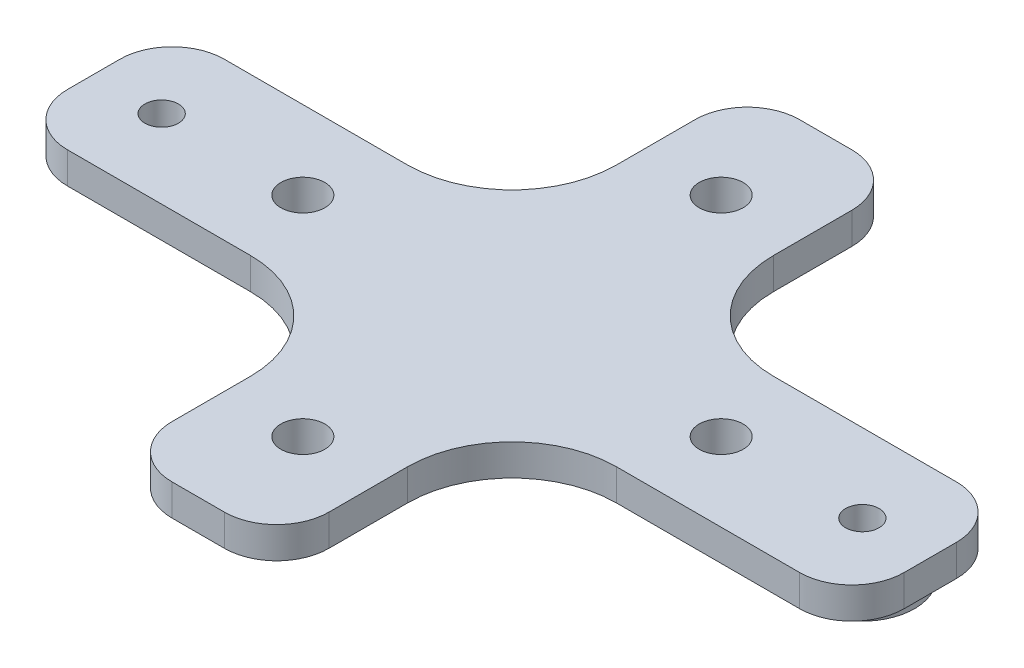
ISO-10303-21;
HEADER;
FILE_DESCRIPTION(('STEP AP214'),'2;1');
FILE_NAME('part.step','',(''),(''),'','','');
FILE_SCHEMA(('AUTOMOTIVE_DESIGN { 1 0 10303 214 1 1 1 1 }'));
ENDSEC;
DATA;
#1=APPLICATION_CONTEXT('core data for automotive mechanical design processes');
#2=APPLICATION_PROTOCOL_DEFINITION('international standard','automotive_design',2000,#1);
#3=PRODUCT_CONTEXT('',#1,'mechanical');
#4=PRODUCT('Part','Part','',(#3));
#5=PRODUCT_RELATED_PRODUCT_CATEGORY('part','',(#4));
#6=PRODUCT_DEFINITION_FORMATION('','',#4);
#7=PRODUCT_DEFINITION_CONTEXT('part definition',#1,'design');
#8=PRODUCT_DEFINITION('design','',#6,#7);
#9=PRODUCT_DEFINITION_SHAPE('','',#8);
#10=(LENGTH_UNIT() NAMED_UNIT(*) SI_UNIT(.MILLI.,.METRE.));
#11=(NAMED_UNIT(*) PLANE_ANGLE_UNIT() SI_UNIT($,.RADIAN.));
#12=(NAMED_UNIT(*) SI_UNIT($,.STERADIAN.) SOLID_ANGLE_UNIT());
#13=UNCERTAINTY_MEASURE_WITH_UNIT(LENGTH_MEASURE(1.E-05),#10,'distance_accuracy_value','');
#14=(GEOMETRIC_REPRESENTATION_CONTEXT(3) GLOBAL_UNCERTAINTY_ASSIGNED_CONTEXT((#13)) GLOBAL_UNIT_ASSIGNED_CONTEXT((#10,
#11,#12)) REPRESENTATION_CONTEXT('',''));
#15=CARTESIAN_POINT('',(0.,0.,0.));
#16=DIRECTION('',(0.,0.,1.));
#17=DIRECTION('',(1.,0.,0.));
#18=AXIS2_PLACEMENT_3D('',#15,#16,#17);
#19=CARTESIAN_POINT('',(-40.,3.,-7.5));
#20=DIRECTION('',(0.,0.,1.));
#21=DIRECTION('',(1.,0.,0.));
#22=AXIS2_PLACEMENT_3D('',#19,#20,#21);
#23=PLANE('',#22);
#24=DIRECTION('',(-1.,0.,0.));
#25=VECTOR('',#24,1.);
#26=CARTESIAN_POINT('',(-40.,0.,-7.5));
#27=LINE('',#26,#25);
#28=CARTESIAN_POINT('',(35.,0.,-7.5));
#29=VERTEX_POINT('',#28);
#30=CARTESIAN_POINT('',(17.5,0.,-7.5));
#31=VERTEX_POINT('',#30);
#32=EDGE_CURVE('E396',#29,#31,#27,.T.);
#33=ORIENTED_EDGE('',*,*,#32,.T.);
#34=DIRECTION('',(0.,1.,0.));
#35=VECTOR('',#34,1.);
#36=CARTESIAN_POINT('',(17.5,3.,-7.5));
#37=LINE('',#36,#35);
#38=CARTESIAN_POINT('',(17.5,3.,-7.5));
#39=VERTEX_POINT('',#38);
#40=EDGE_CURVE('E305',#31,#39,#37,.T.);
#41=ORIENTED_EDGE('',*,*,#40,.T.);
#42=DIRECTION('',(-1.,0.,0.));
#43=VECTOR('',#42,1.);
#44=CARTESIAN_POINT('',(-40.,3.,-7.5));
#45=LINE('',#44,#43);
#46=CARTESIAN_POINT('',(35.,3.,-7.5));
#47=VERTEX_POINT('',#46);
#48=EDGE_CURVE('E387',#47,#39,#45,.T.);
#49=ORIENTED_EDGE('',*,*,#48,.F.);
#50=DIRECTION('',(0.,-1.,0.));
#51=VECTOR('',#50,1.);
#52=CARTESIAN_POINT('',(35.,3.,-7.5));
#53=LINE('',#52,#51);
#54=EDGE_CURVE('E276',#47,#29,#53,.T.);
#55=ORIENTED_EDGE('',*,*,#54,.T.);
#56=EDGE_LOOP('',(#33,#41,#49,#55));
#57=FACE_BOUND('',#56,.T.);
#58=ADVANCED_FACE('F37',(#57),#23,.F.);
#59=CARTESIAN_POINT('',(-40.,3.,7.5));
#60=DIRECTION('',(0.,0.,-1.));
#61=DIRECTION('',(-1.,0.,0.));
#62=AXIS2_PLACEMENT_3D('',#59,#60,#61);
#63=PLANE('',#62);
#64=DIRECTION('',(1.,0.,0.));
#65=VECTOR('',#64,1.);
#66=CARTESIAN_POINT('',(-40.,3.,7.5));
#67=LINE('',#66,#65);
#68=CARTESIAN_POINT('',(17.5,3.,7.5));
#69=VERTEX_POINT('',#68);
#70=CARTESIAN_POINT('',(35.,3.,7.5));
#71=VERTEX_POINT('',#70);
#72=EDGE_CURVE('E229',#69,#71,#67,.T.);
#73=ORIENTED_EDGE('',*,*,#72,.F.);
#74=DIRECTION('',(0.,-1.,0.));
#75=VECTOR('',#74,1.);
#76=CARTESIAN_POINT('',(17.5,3.,7.5));
#77=LINE('',#76,#75);
#78=CARTESIAN_POINT('',(17.5,0.,7.5));
#79=VERTEX_POINT('',#78);
#80=EDGE_CURVE('E300',#69,#79,#77,.T.);
#81=ORIENTED_EDGE('',*,*,#80,.T.);
#82=DIRECTION('',(1.,0.,0.));
#83=VECTOR('',#82,1.);
#84=CARTESIAN_POINT('',(-40.,0.,7.5));
#85=LINE('',#84,#83);
#86=CARTESIAN_POINT('',(35.,0.,7.5));
#87=VERTEX_POINT('',#86);
#88=EDGE_CURVE('E344',#79,#87,#85,.T.);
#89=ORIENTED_EDGE('',*,*,#88,.T.);
#90=DIRECTION('',(0.,-1.,0.));
#91=VECTOR('',#90,1.);
#92=CARTESIAN_POINT('',(35.,3.,7.5));
#93=LINE('',#92,#91);
#94=EDGE_CURVE('E273',#87,#71,#93,.F.);
#95=ORIENTED_EDGE('',*,*,#94,.T.);
#96=EDGE_LOOP('',(#73,#81,#89,#95));
#97=FACE_BOUND('',#96,.T.);
#98=ADVANCED_FACE('F406',(#97),#63,.F.);
#99=CARTESIAN_POINT('',(40.,3.,-7.5));
#100=DIRECTION('',(-1.,0.,0.));
#101=DIRECTION('',(0.,0.,1.));
#102=AXIS2_PLACEMENT_3D('',#99,#100,#101);
#103=PLANE('',#102);
#104=DIRECTION('',(0.,0.,-1.));
#105=VECTOR('',#104,1.);
#106=CARTESIAN_POINT('',(40.,3.,-7.5));
#107=LINE('',#106,#105);
#108=CARTESIAN_POINT('',(40.,3.,2.5));
#109=VERTEX_POINT('',#108);
#110=CARTESIAN_POINT('',(40.,3.,-2.5));
#111=VERTEX_POINT('',#110);
#112=EDGE_CURVE('E343',#109,#111,#107,.T.);
#113=ORIENTED_EDGE('',*,*,#112,.F.);
#114=DIRECTION('',(0.,-1.,0.));
#115=VECTOR('',#114,1.);
#116=CARTESIAN_POINT('',(40.,3.,2.5));
#117=LINE('',#116,#115);
#118=CARTESIAN_POINT('',(40.,0.,2.5));
#119=VERTEX_POINT('',#118);
#120=EDGE_CURVE('E270',#109,#119,#117,.T.);
#121=ORIENTED_EDGE('',*,*,#120,.T.);
#122=DIRECTION('',(0.,0.,-1.));
#123=VECTOR('',#122,1.);
#124=CARTESIAN_POINT('',(40.,0.,-7.5));
#125=LINE('',#124,#123);
#126=CARTESIAN_POINT('',(40.,0.,-2.5));
#127=VERTEX_POINT('',#126);
#128=EDGE_CURVE('E381',#119,#127,#125,.T.);
#129=ORIENTED_EDGE('',*,*,#128,.T.);
#130=DIRECTION('',(0.,-1.,0.));
#131=VECTOR('',#130,1.);
#132=CARTESIAN_POINT('',(40.,3.,-2.5));
#133=LINE('',#132,#131);
#134=EDGE_CURVE('E268',#127,#111,#133,.F.);
#135=ORIENTED_EDGE('',*,*,#134,.T.);
#136=EDGE_LOOP('',(#113,#121,#129,#135));
#137=FACE_BOUND('',#136,.T.);
#138=ADVANCED_FACE('F417',(#137),#103,.F.);
#139=CARTESIAN_POINT('',(-17.5,3.,-7.5));
#140=VERTEX_POINT('',#139);
#141=CARTESIAN_POINT('',(-35.,3.,-7.5));
#142=VERTEX_POINT('',#141);
#143=EDGE_CURVE('E386',#140,#142,#45,.T.);
#144=ORIENTED_EDGE('',*,*,#143,.F.);
#145=DIRECTION('',(0.,-1.,0.));
#146=VECTOR('',#145,1.);
#147=CARTESIAN_POINT('',(-17.5,3.,-7.5));
#148=LINE('',#147,#146);
#149=CARTESIAN_POINT('',(-17.5,0.,-7.5));
#150=VERTEX_POINT('',#149);
#151=EDGE_CURVE('E315',#140,#150,#148,.T.);
#152=ORIENTED_EDGE('',*,*,#151,.T.);
#153=CARTESIAN_POINT('',(-35.,0.,-7.5));
#154=VERTEX_POINT('',#153);
#155=EDGE_CURVE('E395',#150,#154,#27,.T.);
#156=ORIENTED_EDGE('',*,*,#155,.T.);
#157=DIRECTION('',(0.,-1.,0.));
#158=VECTOR('',#157,1.);
#159=CARTESIAN_POINT('',(-35.,3.,-7.5));
#160=LINE('',#159,#158);
#161=EDGE_CURVE('E294',#154,#142,#160,.F.);
#162=ORIENTED_EDGE('',*,*,#161,.T.);
#163=EDGE_LOOP('',(#144,#152,#156,#162));
#164=FACE_BOUND('',#163,.T.);
#165=ADVANCED_FACE('F511',(#164),#23,.F.);
#166=CARTESIAN_POINT('',(-40.,3.,-7.5));
#167=DIRECTION('',(1.,0.,0.));
#168=DIRECTION('',(0.,0.,-1.));
#169=AXIS2_PLACEMENT_3D('',#166,#167,#168);
#170=PLANE('',#169);
#171=DIRECTION('',(0.,0.,1.));
#172=VECTOR('',#171,1.);
#173=CARTESIAN_POINT('',(-40.,3.,-7.5));
#174=LINE('',#173,#172);
#175=CARTESIAN_POINT('',(-40.,3.,-2.5));
#176=VERTEX_POINT('',#175);
#177=CARTESIAN_POINT('',(-40.,3.,2.5));
#178=VERTEX_POINT('',#177);
#179=EDGE_CURVE('E390',#176,#178,#174,.T.);
#180=ORIENTED_EDGE('',*,*,#179,.F.);
#181=DIRECTION('',(0.,-1.,0.));
#182=VECTOR('',#181,1.);
#183=CARTESIAN_POINT('',(-40.,3.,-2.5));
#184=LINE('',#183,#182);
#185=CARTESIAN_POINT('',(-40.,0.,-2.5));
#186=VERTEX_POINT('',#185);
#187=EDGE_CURVE('E291',#176,#186,#184,.T.);
#188=ORIENTED_EDGE('',*,*,#187,.T.);
#189=DIRECTION('',(0.,0.,1.));
#190=VECTOR('',#189,1.);
#191=CARTESIAN_POINT('',(-40.,0.,-7.5));
#192=LINE('',#191,#190);
#193=CARTESIAN_POINT('',(-40.,0.,2.5));
#194=VERTEX_POINT('',#193);
#195=EDGE_CURVE('E398',#186,#194,#192,.T.);
#196=ORIENTED_EDGE('',*,*,#195,.T.);
#197=DIRECTION('',(0.,-1.,0.));
#198=VECTOR('',#197,1.);
#199=CARTESIAN_POINT('',(-40.,3.,2.5));
#200=LINE('',#199,#198);
#201=EDGE_CURVE('E289',#194,#178,#200,.F.);
#202=ORIENTED_EDGE('',*,*,#201,.T.);
#203=EDGE_LOOP('',(#180,#188,#196,#202));
#204=FACE_BOUND('',#203,.T.);
#205=ADVANCED_FACE('F518',(#204),#170,.F.);
#206=CARTESIAN_POINT('',(-35.,0.,7.5));
#207=VERTEX_POINT('',#206);
#208=CARTESIAN_POINT('',(-17.5,0.,7.5));
#209=VERTEX_POINT('',#208);
#210=EDGE_CURVE('E232',#207,#209,#85,.T.);
#211=ORIENTED_EDGE('',*,*,#210,.T.);
#212=DIRECTION('',(0.,1.,0.));
#213=VECTOR('',#212,1.);
#214=CARTESIAN_POINT('',(-17.5,3.,7.5));
#215=LINE('',#214,#213);
#216=CARTESIAN_POINT('',(-17.5,3.,7.5));
#217=VERTEX_POINT('',#216);
#218=EDGE_CURVE('E310',#209,#217,#215,.T.);
#219=ORIENTED_EDGE('',*,*,#218,.T.);
#220=CARTESIAN_POINT('',(-35.,3.,7.5));
#221=VERTEX_POINT('',#220);
#222=EDGE_CURVE('E224',#221,#217,#67,.T.);
#223=ORIENTED_EDGE('',*,*,#222,.F.);
#224=DIRECTION('',(0.,-1.,0.));
#225=VECTOR('',#224,1.);
#226=CARTESIAN_POINT('',(-35.,3.,7.5));
#227=LINE('',#226,#225);
#228=EDGE_CURVE('E297',#221,#207,#227,.T.);
#229=ORIENTED_EDGE('',*,*,#228,.T.);
#230=EDGE_LOOP('',(#211,#219,#223,#229));
#231=FACE_BOUND('',#230,.T.);
#232=ADVANCED_FACE('F340',(#231),#63,.F.);
#233=CARTESIAN_POINT('',(0.,3.,0.));
#234=DIRECTION('',(0.,1.,0.));
#235=DIRECTION('',(0.,0.,1.));
#236=AXIS2_PLACEMENT_3D('',#233,#234,#235);
#237=PLANE('',#236);
#238=CARTESIAN_POINT('',(-33.5,3.,0.));
#239=DIRECTION('',(0.,-1.,0.));
#240=DIRECTION('',(0.,0.,-1.));
#241=AXIS2_PLACEMENT_3D('',#238,#239,#240);
#242=CIRCLE('',#241,1.6);
#243=CARTESIAN_POINT('',(-33.5,3.,-1.6));
#244=VERTEX_POINT('',#243);
#245=EDGE_CURVE('E456',#244,#244,#242,.T.);
#246=ORIENTED_EDGE('',*,*,#245,.T.);
#247=EDGE_LOOP('',(#246));
#248=FACE_BOUND('',#247,.T.);
#249=CARTESIAN_POINT('',(33.5,3.,0.));
#250=DIRECTION('',(0.,-1.,0.));
#251=DIRECTION('',(0.,0.,-1.));
#252=AXIS2_PLACEMENT_3D('',#249,#250,#251);
#253=CIRCLE('',#252,1.6);
#254=CARTESIAN_POINT('',(33.5,3.,-1.6));
#255=VERTEX_POINT('',#254);
#256=EDGE_CURVE('E467',#255,#255,#253,.T.);
#257=ORIENTED_EDGE('',*,*,#256,.T.);
#258=EDGE_LOOP('',(#257));
#259=FACE_BOUND('',#258,.T.);
#260=CARTESIAN_POINT('',(-20.,3.,0.));
#261=DIRECTION('',(0.,-1.,0.));
#262=DIRECTION('',(0.,0.,-1.));
#263=AXIS2_PLACEMENT_3D('',#260,#261,#262);
#264=CIRCLE('',#263,2.1);
#265=CARTESIAN_POINT('',(-20.,3.,-2.1));
#266=VERTEX_POINT('',#265);
#267=EDGE_CURVE('E443',#266,#266,#264,.T.);
#268=ORIENTED_EDGE('',*,*,#267,.T.);
#269=EDGE_LOOP('',(#268));
#270=FACE_BOUND('',#269,.T.);
#271=CARTESIAN_POINT('',(20.,3.,0.));
#272=DIRECTION('',(0.,-1.,0.));
#273=DIRECTION('',(0.,0.,-1.));
#274=AXIS2_PLACEMENT_3D('',#271,#272,#273);
#275=CIRCLE('',#274,2.1);
#276=CARTESIAN_POINT('',(20.,3.,-2.1));
#277=VERTEX_POINT('',#276);
#278=EDGE_CURVE('E455',#277,#277,#275,.T.);
#279=ORIENTED_EDGE('',*,*,#278,.T.);
#280=EDGE_LOOP('',(#279));
#281=FACE_BOUND('',#280,.T.);
#282=CARTESIAN_POINT('',(0.,3.,20.));
#283=DIRECTION('',(0.,-1.,0.));
#284=DIRECTION('',(0.,0.,-1.));
#285=AXIS2_PLACEMENT_3D('',#282,#283,#284);
#286=CIRCLE('',#285,2.1);
#287=CARTESIAN_POINT('',(0.,3.,17.9));
#288=VERTEX_POINT('',#287);
#289=EDGE_CURVE('E449',#288,#288,#286,.T.);
#290=ORIENTED_EDGE('',*,*,#289,.T.);
#291=EDGE_LOOP('',(#290));
#292=FACE_BOUND('',#291,.T.);
#293=CARTESIAN_POINT('',(0.,3.,-20.));
#294=DIRECTION('',(0.,-1.,0.));
#295=DIRECTION('',(0.,0.,-1.));
#296=AXIS2_PLACEMENT_3D('',#293,#294,#295);
#297=CIRCLE('',#296,2.1);
#298=CARTESIAN_POINT('',(0.,3.,-22.1));
#299=VERTEX_POINT('',#298);
#300=EDGE_CURVE('E442',#299,#299,#297,.T.);
#301=ORIENTED_EDGE('',*,*,#300,.T.);
#302=EDGE_LOOP('',(#301));
#303=FACE_BOUND('',#302,.T.);
#304=DIRECTION('',(0.,0.,-1.));
#305=VECTOR('',#304,1.);
#306=CARTESIAN_POINT('',(-7.5,3.,30.));
#307=LINE('',#306,#305);
#308=CARTESIAN_POINT('',(-7.5,3.,25.));
#309=VERTEX_POINT('',#308);
#310=CARTESIAN_POINT('',(-7.5,3.,17.5));
#311=VERTEX_POINT('',#310);
#312=EDGE_CURVE('E350',#309,#311,#307,.T.);
#313=ORIENTED_EDGE('',*,*,#312,.F.);
#314=CARTESIAN_POINT('',(-2.5,3.,25.));
#315=DIRECTION('',(0.,1.,0.));
#316=DIRECTION('',(0.,0.,1.));
#317=AXIS2_PLACEMENT_3D('',#314,#315,#316);
#318=CIRCLE('',#317,5.);
#319=CARTESIAN_POINT('',(-2.5,3.,30.));
#320=VERTEX_POINT('',#319);
#321=EDGE_CURVE('E264',#309,#320,#318,.T.);
#322=ORIENTED_EDGE('',*,*,#321,.T.);
#323=DIRECTION('',(-1.,0.,0.));
#324=VECTOR('',#323,1.);
#325=CARTESIAN_POINT('',(-7.5,3.,30.));
#326=LINE('',#325,#324);
#327=CARTESIAN_POINT('',(2.5,3.,30.));
#328=VERTEX_POINT('',#327);
#329=EDGE_CURVE('E361',#328,#320,#326,.T.);
#330=ORIENTED_EDGE('',*,*,#329,.F.);
#331=CARTESIAN_POINT('',(2.5,3.,25.));
#332=DIRECTION('',(0.,1.,0.));
#333=DIRECTION('',(0.,0.,1.));
#334=AXIS2_PLACEMENT_3D('',#331,#332,#333);
#335=CIRCLE('',#334,5.);
#336=CARTESIAN_POINT('',(7.5,3.,25.));
#337=VERTEX_POINT('',#336);
#338=EDGE_CURVE('E223',#328,#337,#335,.T.);
#339=ORIENTED_EDGE('',*,*,#338,.T.);
#340=DIRECTION('',(0.,0.,1.));
#341=VECTOR('',#340,1.);
#342=CARTESIAN_POINT('',(7.5,3.,30.));
#343=LINE('',#342,#341);
#344=CARTESIAN_POINT('',(7.5,3.,17.5));
#345=VERTEX_POINT('',#344);
#346=EDGE_CURVE('E371',#345,#337,#343,.T.);
#347=ORIENTED_EDGE('',*,*,#346,.F.);
#348=CARTESIAN_POINT('',(17.5,3.,17.5));
#349=DIRECTION('',(0.,1.,0.));
#350=DIRECTION('',(0.,0.,1.));
#351=AXIS2_PLACEMENT_3D('',#348,#349,#350);
#352=CIRCLE('',#351,10.);
#353=EDGE_CURVE('E321',#345,#69,#352,.F.);
#354=ORIENTED_EDGE('',*,*,#353,.T.);
#355=ORIENTED_EDGE('',*,*,#72,.T.);
#356=CARTESIAN_POINT('',(35.,3.,2.5));
#357=DIRECTION('',(0.,1.,0.));
#358=DIRECTION('',(0.,0.,1.));
#359=AXIS2_PLACEMENT_3D('',#356,#357,#358);
#360=CIRCLE('',#359,5.);
#361=EDGE_CURVE('E261',#71,#109,#360,.T.);
#362=ORIENTED_EDGE('',*,*,#361,.T.);
#363=ORIENTED_EDGE('',*,*,#112,.T.);
#364=CARTESIAN_POINT('',(35.,3.,-2.5));
#365=DIRECTION('',(0.,1.,0.));
#366=DIRECTION('',(0.,0.,1.));
#367=AXIS2_PLACEMENT_3D('',#364,#365,#366);
#368=CIRCLE('',#367,5.);
#369=EDGE_CURVE('E259',#111,#47,#368,.T.);
#370=ORIENTED_EDGE('',*,*,#369,.T.);
#371=ORIENTED_EDGE('',*,*,#48,.T.);
#372=CARTESIAN_POINT('',(17.5,3.,-17.5));
#373=DIRECTION('',(0.,1.,0.));
#374=DIRECTION('',(0.,0.,1.));
#375=AXIS2_PLACEMENT_3D('',#372,#373,#374);
#376=CIRCLE('',#375,10.);
#377=CARTESIAN_POINT('',(7.5,3.,-17.5));
#378=VERTEX_POINT('',#377);
#379=EDGE_CURVE('E323',#39,#378,#376,.F.);
#380=ORIENTED_EDGE('',*,*,#379,.T.);
#381=CARTESIAN_POINT('',(7.5,3.,-25.));
#382=VERTEX_POINT('',#381);
#383=EDGE_CURVE('E432',#382,#378,#343,.T.);
#384=ORIENTED_EDGE('',*,*,#383,.F.);
#385=CARTESIAN_POINT('',(2.5,3.,-25.));
#386=DIRECTION('',(0.,1.,0.));
#387=DIRECTION('',(0.,0.,1.));
#388=AXIS2_PLACEMENT_3D('',#385,#386,#387);
#389=CIRCLE('',#388,5.);
#390=CARTESIAN_POINT('',(2.5,3.,-30.));
#391=VERTEX_POINT('',#390);
#392=EDGE_CURVE('E257',#382,#391,#389,.T.);
#393=ORIENTED_EDGE('',*,*,#392,.T.);
#394=DIRECTION('',(1.,0.,0.));
#395=VECTOR('',#394,1.);
#396=CARTESIAN_POINT('',(-7.5,3.,-30.));
#397=LINE('',#396,#395);
#398=CARTESIAN_POINT('',(-2.5,3.,-30.));
#399=VERTEX_POINT('',#398);
#400=EDGE_CURVE('E355',#399,#391,#397,.T.);
#401=ORIENTED_EDGE('',*,*,#400,.F.);
#402=CARTESIAN_POINT('',(-2.5,3.,-25.));
#403=DIRECTION('',(0.,1.,0.));
#404=DIRECTION('',(0.,0.,1.));
#405=AXIS2_PLACEMENT_3D('',#402,#403,#404);
#406=CIRCLE('',#405,5.);
#407=CARTESIAN_POINT('',(-7.5,3.,-25.));
#408=VERTEX_POINT('',#407);
#409=EDGE_CURVE('E254',#399,#408,#406,.T.);
#410=ORIENTED_EDGE('',*,*,#409,.T.);
#411=CARTESIAN_POINT('',(-7.5,3.,-17.5));
#412=VERTEX_POINT('',#411);
#413=EDGE_CURVE('E356',#412,#408,#307,.T.);
#414=ORIENTED_EDGE('',*,*,#413,.F.);
#415=CARTESIAN_POINT('',(-17.5,3.,-17.5));
#416=DIRECTION('',(0.,1.,0.));
#417=DIRECTION('',(0.,0.,1.));
#418=AXIS2_PLACEMENT_3D('',#415,#416,#417);
#419=CIRCLE('',#418,10.);
#420=EDGE_CURVE('E11',#412,#140,#419,.F.);
#421=ORIENTED_EDGE('',*,*,#420,.T.);
#422=ORIENTED_EDGE('',*,*,#143,.T.);
#423=CARTESIAN_POINT('',(-35.,3.,-2.5));
#424=DIRECTION('',(0.,1.,0.));
#425=DIRECTION('',(0.,0.,1.));
#426=AXIS2_PLACEMENT_3D('',#423,#424,#425);
#427=CIRCLE('',#426,5.);
#428=EDGE_CURVE('E252',#142,#176,#427,.T.);
#429=ORIENTED_EDGE('',*,*,#428,.T.);
#430=ORIENTED_EDGE('',*,*,#179,.T.);
#431=CARTESIAN_POINT('',(-35.,3.,2.5));
#432=DIRECTION('',(0.,1.,0.));
#433=DIRECTION('',(0.,0.,1.));
#434=AXIS2_PLACEMENT_3D('',#431,#432,#433);
#435=CIRCLE('',#434,5.);
#436=EDGE_CURVE('E250',#178,#221,#435,.T.);
#437=ORIENTED_EDGE('',*,*,#436,.T.);
#438=ORIENTED_EDGE('',*,*,#222,.T.);
#439=CARTESIAN_POINT('',(-17.5,3.,17.5));
#440=DIRECTION('',(0.,1.,0.));
#441=DIRECTION('',(0.,0.,1.));
#442=AXIS2_PLACEMENT_3D('',#439,#440,#441);
#443=CIRCLE('',#442,10.);
#444=EDGE_CURVE('E327',#217,#311,#443,.F.);
#445=ORIENTED_EDGE('',*,*,#444,.T.);
#446=EDGE_LOOP('',(#313,#322,#330,#339,#347,#354,#355,#362,#363,#370,#371,#380,#384,#393,#401,
#410,#414,#421,#422,#429,#430,#437,#438,#445));
#447=FACE_BOUND('',#446,.T.);
#448=ADVANCED_FACE('F349',(#248,#259,#270,#281,#292,#303,#447),#237,.T.);
#449=CARTESIAN_POINT('',(0.,0.,0.));
#450=DIRECTION('',(0.,1.,0.));
#451=DIRECTION('',(0.,0.,1.));
#452=AXIS2_PLACEMENT_3D('',#449,#450,#451);
#453=PLANE('',#452);
#454=CARTESIAN_POINT('',(-20.,0.,0.));
#455=DIRECTION('',(0.,-1.,0.));
#456=DIRECTION('',(0.,0.,-1.));
#457=AXIS2_PLACEMENT_3D('',#454,#455,#456);
#458=CIRCLE('',#457,2.1);
#459=CARTESIAN_POINT('',(-20.,0.,-2.1));
#460=VERTEX_POINT('',#459);
#461=EDGE_CURVE('E459',#460,#460,#458,.T.);
#462=ORIENTED_EDGE('',*,*,#461,.F.);
#463=EDGE_LOOP('',(#462));
#464=FACE_BOUND('',#463,.T.);
#465=CARTESIAN_POINT('',(20.,0.,0.));
#466=DIRECTION('',(0.,-1.,0.));
#467=DIRECTION('',(0.,0.,-1.));
#468=AXIS2_PLACEMENT_3D('',#465,#466,#467);
#469=CIRCLE('',#468,2.1);
#470=CARTESIAN_POINT('',(20.,0.,-2.1));
#471=VERTEX_POINT('',#470);
#472=EDGE_CURVE('E452',#471,#471,#469,.T.);
#473=ORIENTED_EDGE('',*,*,#472,.F.);
#474=EDGE_LOOP('',(#473));
#475=FACE_BOUND('',#474,.T.);
#476=CARTESIAN_POINT('',(0.,0.,20.));
#477=DIRECTION('',(0.,-1.,0.));
#478=DIRECTION('',(0.,0.,-1.));
#479=AXIS2_PLACEMENT_3D('',#476,#477,#478);
#480=CIRCLE('',#479,2.1);
#481=CARTESIAN_POINT('',(0.,0.,17.9));
#482=VERTEX_POINT('',#481);
#483=EDGE_CURVE('E446',#482,#482,#480,.T.);
#484=ORIENTED_EDGE('',*,*,#483,.F.);
#485=EDGE_LOOP('',(#484));
#486=FACE_BOUND('',#485,.T.);
#487=CARTESIAN_POINT('',(0.,0.,-20.));
#488=DIRECTION('',(0.,-1.,0.));
#489=DIRECTION('',(0.,0.,-1.));
#490=AXIS2_PLACEMENT_3D('',#487,#488,#489);
#491=CIRCLE('',#490,2.1);
#492=CARTESIAN_POINT('',(0.,0.,-22.1));
#493=VERTEX_POINT('',#492);
#494=EDGE_CURVE('E439',#493,#493,#491,.T.);
#495=ORIENTED_EDGE('',*,*,#494,.F.);
#496=EDGE_LOOP('',(#495));
#497=FACE_BOUND('',#496,.T.);
#498=CARTESIAN_POINT('',(-33.5,0.,0.));
#499=DIRECTION('',(0.,1.,0.));
#500=DIRECTION('',(0.,0.,1.));
#501=AXIS2_PLACEMENT_3D('',#498,#499,#500);
#502=CIRCLE('',#501,5.);
#503=CARTESIAN_POINT('',(-33.5,0.,5.));
#504=VERTEX_POINT('',#503);
#505=EDGE_CURVE('E375',#504,#504,#502,.T.);
#506=ORIENTED_EDGE('',*,*,#505,.T.);
#507=EDGE_LOOP('',(#506));
#508=FACE_BOUND('',#507,.T.);
#509=DIRECTION('',(-1.,0.,0.));
#510=VECTOR('',#509,1.);
#511=CARTESIAN_POINT('',(-7.5,0.,30.));
#512=LINE('',#511,#510);
#513=CARTESIAN_POINT('',(2.5,0.,30.));
#514=VERTEX_POINT('',#513);
#515=CARTESIAN_POINT('',(-2.5,0.,30.));
#516=VERTEX_POINT('',#515);
#517=EDGE_CURVE('E199',#514,#516,#512,.T.);
#518=ORIENTED_EDGE('',*,*,#517,.T.);
#519=CARTESIAN_POINT('',(-2.5,0.,25.));
#520=DIRECTION('',(0.,1.,0.));
#521=DIRECTION('',(0.,0.,1.));
#522=AXIS2_PLACEMENT_3D('',#519,#520,#521);
#523=CIRCLE('',#522,5.);
#524=CARTESIAN_POINT('',(-7.5,0.,25.));
#525=VERTEX_POINT('',#524);
#526=EDGE_CURVE('E206',#516,#525,#523,.F.);
#527=ORIENTED_EDGE('',*,*,#526,.T.);
#528=DIRECTION('',(0.,0.,-1.));
#529=VECTOR('',#528,1.);
#530=CARTESIAN_POINT('',(-7.5,0.,30.));
#531=LINE('',#530,#529);
#532=CARTESIAN_POINT('',(-7.5,0.,17.5));
#533=VERTEX_POINT('',#532);
#534=EDGE_CURVE('E335',#525,#533,#531,.T.);
#535=ORIENTED_EDGE('',*,*,#534,.T.);
#536=CARTESIAN_POINT('',(-17.5,0.,17.5));
#537=DIRECTION('',(0.,1.,0.));
#538=DIRECTION('',(0.,0.,1.));
#539=AXIS2_PLACEMENT_3D('',#536,#537,#538);
#540=CIRCLE('',#539,10.);
#541=EDGE_CURVE('E329',#533,#209,#540,.T.);
#542=ORIENTED_EDGE('',*,*,#541,.T.);
#543=ORIENTED_EDGE('',*,*,#210,.F.);
#544=CARTESIAN_POINT('',(-35.,0.,2.5));
#545=DIRECTION('',(0.,1.,0.));
#546=DIRECTION('',(0.,0.,1.));
#547=AXIS2_PLACEMENT_3D('',#544,#545,#546);
#548=CIRCLE('',#547,5.);
#549=EDGE_CURVE('E226',#207,#194,#548,.F.);
#550=ORIENTED_EDGE('',*,*,#549,.T.);
#551=ORIENTED_EDGE('',*,*,#195,.F.);
#552=CARTESIAN_POINT('',(-35.,0.,-2.5));
#553=DIRECTION('',(0.,1.,0.));
#554=DIRECTION('',(0.,0.,1.));
#555=AXIS2_PLACEMENT_3D('',#552,#553,#554);
#556=CIRCLE('',#555,5.);
#557=EDGE_CURVE('E236',#186,#154,#556,.F.);
#558=ORIENTED_EDGE('',*,*,#557,.T.);
#559=ORIENTED_EDGE('',*,*,#155,.F.);
#560=CARTESIAN_POINT('',(-17.5,0.,-17.5));
#561=DIRECTION('',(0.,1.,0.));
#562=DIRECTION('',(0.,0.,1.));
#563=AXIS2_PLACEMENT_3D('',#560,#561,#562);
#564=CIRCLE('',#563,10.);
#565=CARTESIAN_POINT('',(-7.5,0.,-17.5));
#566=VERTEX_POINT('',#565);
#567=EDGE_CURVE('E45',#150,#566,#564,.T.);
#568=ORIENTED_EDGE('',*,*,#567,.T.);
#569=CARTESIAN_POINT('',(-7.5,0.,-25.));
#570=VERTEX_POINT('',#569);
#571=EDGE_CURVE('E217',#566,#570,#531,.T.);
#572=ORIENTED_EDGE('',*,*,#571,.T.);
#573=CARTESIAN_POINT('',(-2.5,0.,-25.));
#574=DIRECTION('',(0.,1.,0.));
#575=DIRECTION('',(0.,0.,1.));
#576=AXIS2_PLACEMENT_3D('',#573,#574,#575);
#577=CIRCLE('',#576,5.);
#578=CARTESIAN_POINT('',(-2.5,0.,-30.));
#579=VERTEX_POINT('',#578);
#580=EDGE_CURVE('E239',#570,#579,#577,.F.);
#581=ORIENTED_EDGE('',*,*,#580,.T.);
#582=DIRECTION('',(1.,0.,0.));
#583=VECTOR('',#582,1.);
#584=CARTESIAN_POINT('',(-7.5,0.,-30.));
#585=LINE('',#584,#583);
#586=CARTESIAN_POINT('',(2.5,0.,-30.));
#587=VERTEX_POINT('',#586);
#588=EDGE_CURVE('E368',#579,#587,#585,.T.);
#589=ORIENTED_EDGE('',*,*,#588,.T.);
#590=CARTESIAN_POINT('',(2.5,0.,-25.));
#591=DIRECTION('',(0.,1.,0.));
#592=DIRECTION('',(0.,0.,1.));
#593=AXIS2_PLACEMENT_3D('',#590,#591,#592);
#594=CIRCLE('',#593,5.);
#595=CARTESIAN_POINT('',(7.5,0.,-25.));
#596=VERTEX_POINT('',#595);
#597=EDGE_CURVE('E241',#587,#596,#594,.F.);
#598=ORIENTED_EDGE('',*,*,#597,.T.);
#599=DIRECTION('',(0.,0.,1.));
#600=VECTOR('',#599,1.);
#601=CARTESIAN_POINT('',(7.5,0.,30.));
#602=LINE('',#601,#600);
#603=CARTESIAN_POINT('',(7.5,0.,-17.5));
#604=VERTEX_POINT('',#603);
#605=EDGE_CURVE('E218',#596,#604,#602,.T.);
#606=ORIENTED_EDGE('',*,*,#605,.T.);
#607=CARTESIAN_POINT('',(17.5,0.,-17.5));
#608=DIRECTION('',(0.,1.,0.));
#609=DIRECTION('',(0.,0.,1.));
#610=AXIS2_PLACEMENT_3D('',#607,#608,#609);
#611=CIRCLE('',#610,10.);
#612=EDGE_CURVE('E325',#604,#31,#611,.T.);
#613=ORIENTED_EDGE('',*,*,#612,.T.);
#614=ORIENTED_EDGE('',*,*,#32,.F.);
#615=CARTESIAN_POINT('',(35.,0.,-2.5));
#616=DIRECTION('',(0.,1.,0.));
#617=DIRECTION('',(0.,0.,1.));
#618=AXIS2_PLACEMENT_3D('',#615,#616,#617);
#619=CIRCLE('',#618,5.);
#620=EDGE_CURVE('E243',#29,#127,#619,.F.);
#621=ORIENTED_EDGE('',*,*,#620,.T.);
#622=ORIENTED_EDGE('',*,*,#128,.F.);
#623=CARTESIAN_POINT('',(35.,0.,2.5));
#624=DIRECTION('',(0.,1.,0.));
#625=DIRECTION('',(0.,0.,1.));
#626=AXIS2_PLACEMENT_3D('',#623,#624,#625);
#627=CIRCLE('',#626,5.);
#628=EDGE_CURVE('E207',#119,#87,#627,.F.);
#629=ORIENTED_EDGE('',*,*,#628,.T.);
#630=ORIENTED_EDGE('',*,*,#88,.F.);
#631=CARTESIAN_POINT('',(17.5,0.,17.5));
#632=DIRECTION('',(0.,1.,0.));
#633=DIRECTION('',(0.,0.,1.));
#634=AXIS2_PLACEMENT_3D('',#631,#632,#633);
#635=CIRCLE('',#634,10.);
#636=CARTESIAN_POINT('',(7.5,0.,17.5));
#637=VERTEX_POINT('',#636);
#638=EDGE_CURVE('E319',#79,#637,#635,.T.);
#639=ORIENTED_EDGE('',*,*,#638,.T.);
#640=CARTESIAN_POINT('',(7.5,0.,25.));
#641=VERTEX_POINT('',#640);
#642=EDGE_CURVE('E201',#637,#641,#602,.T.);
#643=ORIENTED_EDGE('',*,*,#642,.T.);
#644=CARTESIAN_POINT('',(2.5,0.,25.));
#645=DIRECTION('',(0.,1.,0.));
#646=DIRECTION('',(0.,0.,1.));
#647=AXIS2_PLACEMENT_3D('',#644,#645,#646);
#648=CIRCLE('',#647,5.);
#649=EDGE_CURVE('E195',#641,#514,#648,.F.);
#650=ORIENTED_EDGE('',*,*,#649,.T.);
#651=EDGE_LOOP('',(#518,#527,#535,#542,#543,#550,#551,#558,#559,#568,#572,#581,#589,#598,#606,
#613,#614,#621,#622,#629,#630,#639,#643,#650));
#652=FACE_BOUND('',#651,.T.);
#653=CARTESIAN_POINT('',(33.5,0.,0.));
#654=DIRECTION('',(0.,1.,0.));
#655=DIRECTION('',(0.,0.,1.));
#656=AXIS2_PLACEMENT_3D('',#653,#654,#655);
#657=CIRCLE('',#656,5.);
#658=CARTESIAN_POINT('',(33.5,0.,5.));
#659=VERTEX_POINT('',#658);
#660=EDGE_CURVE('E359',#659,#659,#657,.T.);
#661=ORIENTED_EDGE('',*,*,#660,.T.);
#662=EDGE_LOOP('',(#661));
#663=FACE_BOUND('',#662,.T.);
#664=ADVANCED_FACE('F197',(#464,#475,#486,#497,#508,#652,#663),#453,.F.);
#665=CARTESIAN_POINT('',(-33.5,-2.,0.));
#666=DIRECTION('',(0.,1.,0.));
#667=DIRECTION('',(0.,0.,1.));
#668=AXIS2_PLACEMENT_3D('',#665,#666,#667);
#669=CYLINDRICAL_SURFACE('',#668,5.);
#670=CARTESIAN_POINT('',(-33.5,-2.,0.));
#671=DIRECTION('',(0.,1.,0.));
#672=DIRECTION('',(0.,0.,1.));
#673=AXIS2_PLACEMENT_3D('',#670,#671,#672);
#674=CIRCLE('',#673,5.);
#675=CARTESIAN_POINT('',(-33.5,-2.,5.));
#676=VERTEX_POINT('',#675);
#677=EDGE_CURVE('E378',#676,#676,#674,.T.);
#678=ORIENTED_EDGE('',*,*,#677,.T.);
#679=EDGE_LOOP('',(#678));
#680=FACE_BOUND('',#679,.T.);
#681=ORIENTED_EDGE('',*,*,#505,.F.);
#682=EDGE_LOOP('',(#681));
#683=FACE_BOUND('',#682,.T.);
#684=ADVANCED_FACE('F490',(#680,#683),#669,.T.);
#685=CARTESIAN_POINT('',(-33.5,-2.,0.));
#686=DIRECTION('',(0.,1.,0.));
#687=DIRECTION('',(0.,0.,1.));
#688=AXIS2_PLACEMENT_3D('',#685,#686,#687);
#689=PLANE('',#688);
#690=CARTESIAN_POINT('',(-33.5,-2.,0.));
#691=DIRECTION('',(0.,-1.,0.));
#692=DIRECTION('',(0.,0.,-1.));
#693=AXIS2_PLACEMENT_3D('',#690,#691,#692);
#694=CIRCLE('',#693,1.6);
#695=CARTESIAN_POINT('',(-33.5,-2.,-1.6));
#696=VERTEX_POINT('',#695);
#697=EDGE_CURVE('E470',#696,#696,#694,.T.);
#698=ORIENTED_EDGE('',*,*,#697,.F.);
#699=EDGE_LOOP('',(#698));
#700=FACE_BOUND('',#699,.T.);
#701=ORIENTED_EDGE('',*,*,#677,.F.);
#702=EDGE_LOOP('',(#701));
#703=FACE_BOUND('',#702,.T.);
#704=ADVANCED_FACE('F486',(#700,#703),#689,.F.);
#705=CARTESIAN_POINT('',(33.5,-2.,0.));
#706=DIRECTION('',(0.,1.,0.));
#707=DIRECTION('',(0.,0.,1.));
#708=AXIS2_PLACEMENT_3D('',#705,#706,#707);
#709=CYLINDRICAL_SURFACE('',#708,5.);
#710=CARTESIAN_POINT('',(33.5,-2.,0.));
#711=DIRECTION('',(0.,1.,0.));
#712=DIRECTION('',(0.,0.,1.));
#713=AXIS2_PLACEMENT_3D('',#710,#711,#712);
#714=CIRCLE('',#713,5.);
#715=CARTESIAN_POINT('',(33.5,-2.,5.));
#716=VERTEX_POINT('',#715);
#717=EDGE_CURVE('E372',#716,#716,#714,.T.);
#718=ORIENTED_EDGE('',*,*,#717,.T.);
#719=EDGE_LOOP('',(#718));
#720=FACE_BOUND('',#719,.T.);
#721=ORIENTED_EDGE('',*,*,#660,.F.);
#722=EDGE_LOOP('',(#721));
#723=FACE_BOUND('',#722,.T.);
#724=ADVANCED_FACE('F489',(#720,#723),#709,.T.);
#725=CARTESIAN_POINT('',(33.5,-2.,0.));
#726=DIRECTION('',(0.,1.,0.));
#727=DIRECTION('',(0.,0.,1.));
#728=AXIS2_PLACEMENT_3D('',#725,#726,#727);
#729=PLANE('',#728);
#730=CARTESIAN_POINT('',(33.5,-2.,0.));
#731=DIRECTION('',(0.,-1.,0.));
#732=DIRECTION('',(0.,0.,-1.));
#733=AXIS2_PLACEMENT_3D('',#730,#731,#732);
#734=CIRCLE('',#733,1.6);
#735=CARTESIAN_POINT('',(33.5,-2.,-1.6));
#736=VERTEX_POINT('',#735);
#737=EDGE_CURVE('E464',#736,#736,#734,.T.);
#738=ORIENTED_EDGE('',*,*,#737,.F.);
#739=EDGE_LOOP('',(#738));
#740=FACE_BOUND('',#739,.T.);
#741=ORIENTED_EDGE('',*,*,#717,.F.);
#742=EDGE_LOOP('',(#741));
#743=FACE_BOUND('',#742,.T.);
#744=ADVANCED_FACE('F681',(#740,#743),#729,.F.);
#745=CARTESIAN_POINT('',(-7.5,3.,30.));
#746=DIRECTION('',(0.,0.,1.));
#747=DIRECTION('',(1.,0.,0.));
#748=AXIS2_PLACEMENT_3D('',#745,#746,#747);
#749=PLANE('',#748);
#750=ORIENTED_EDGE('',*,*,#329,.T.);
#751=DIRECTION('',(0.,-1.,0.));
#752=VECTOR('',#751,1.);
#753=CARTESIAN_POINT('',(-2.5,3.,30.));
#754=LINE('',#753,#752);
#755=EDGE_CURVE('E216',#320,#516,#754,.T.);
#756=ORIENTED_EDGE('',*,*,#755,.T.);
#757=ORIENTED_EDGE('',*,*,#517,.F.);
#758=DIRECTION('',(0.,-1.,0.));
#759=VECTOR('',#758,1.);
#760=CARTESIAN_POINT('',(2.5,3.,30.));
#761=LINE('',#760,#759);
#762=EDGE_CURVE('E213',#514,#328,#761,.F.);
#763=ORIENTED_EDGE('',*,*,#762,.T.);
#764=EDGE_LOOP('',(#750,#756,#757,#763));
#765=FACE_BOUND('',#764,.T.);
#766=ADVANCED_FACE('F212',(#765),#749,.T.);
#767=CARTESIAN_POINT('',(-7.5,3.,30.));
#768=DIRECTION('',(-1.,0.,0.));
#769=DIRECTION('',(0.,0.,1.));
#770=AXIS2_PLACEMENT_3D('',#767,#768,#769);
#771=PLANE('',#770);
#772=ORIENTED_EDGE('',*,*,#312,.T.);
#773=DIRECTION('',(0.,1.,0.));
#774=VECTOR('',#773,1.);
#775=CARTESIAN_POINT('',(-7.5,3.,17.5));
#776=LINE('',#775,#774);
#777=EDGE_CURVE('E313',#311,#533,#776,.F.);
#778=ORIENTED_EDGE('',*,*,#777,.T.);
#779=ORIENTED_EDGE('',*,*,#534,.F.);
#780=DIRECTION('',(0.,-1.,0.));
#781=VECTOR('',#780,1.);
#782=CARTESIAN_POINT('',(-7.5,3.,25.));
#783=LINE('',#782,#781);
#784=EDGE_CURVE('E248',#525,#309,#783,.F.);
#785=ORIENTED_EDGE('',*,*,#784,.T.);
#786=EDGE_LOOP('',(#772,#778,#779,#785));
#787=FACE_BOUND('',#786,.T.);
#788=ADVANCED_FACE('F353',(#787),#771,.T.);
#789=CARTESIAN_POINT('',(7.5,3.,30.));
#790=DIRECTION('',(1.,0.,0.));
#791=DIRECTION('',(0.,0.,-1.));
#792=AXIS2_PLACEMENT_3D('',#789,#790,#791);
#793=PLANE('',#792);
#794=ORIENTED_EDGE('',*,*,#642,.F.);
#795=DIRECTION('',(0.,-1.,0.));
#796=VECTOR('',#795,1.);
#797=CARTESIAN_POINT('',(7.5,3.,17.5));
#798=LINE('',#797,#796);
#799=EDGE_CURVE('E303',#637,#345,#798,.F.);
#800=ORIENTED_EDGE('',*,*,#799,.T.);
#801=ORIENTED_EDGE('',*,*,#346,.T.);
#802=DIRECTION('',(0.,-1.,0.));
#803=VECTOR('',#802,1.);
#804=CARTESIAN_POINT('',(7.5,3.,25.));
#805=LINE('',#804,#803);
#806=EDGE_CURVE('E266',#337,#641,#805,.T.);
#807=ORIENTED_EDGE('',*,*,#806,.T.);
#808=EDGE_LOOP('',(#794,#800,#801,#807));
#809=FACE_BOUND('',#808,.T.);
#810=ADVANCED_FACE('F608',(#809),#793,.T.);
#811=ORIENTED_EDGE('',*,*,#383,.T.);
#812=DIRECTION('',(0.,1.,0.));
#813=VECTOR('',#812,1.);
#814=CARTESIAN_POINT('',(7.5,3.,-17.5));
#815=LINE('',#814,#813);
#816=EDGE_CURVE('E308',#378,#604,#815,.F.);
#817=ORIENTED_EDGE('',*,*,#816,.T.);
#818=ORIENTED_EDGE('',*,*,#605,.F.);
#819=DIRECTION('',(0.,-1.,0.));
#820=VECTOR('',#819,1.);
#821=CARTESIAN_POINT('',(7.5,3.,-25.));
#822=LINE('',#821,#820);
#823=EDGE_CURVE('E284',#596,#382,#822,.F.);
#824=ORIENTED_EDGE('',*,*,#823,.T.);
#825=EDGE_LOOP('',(#811,#817,#818,#824));
#826=FACE_BOUND('',#825,.T.);
#827=ADVANCED_FACE('F435',(#826),#793,.T.);
#828=ORIENTED_EDGE('',*,*,#571,.F.);
#829=DIRECTION('',(0.,-1.,0.));
#830=VECTOR('',#829,1.);
#831=CARTESIAN_POINT('',(-7.5,3.,-17.5));
#832=LINE('',#831,#830);
#833=EDGE_CURVE('E58',#566,#412,#832,.F.);
#834=ORIENTED_EDGE('',*,*,#833,.T.);
#835=ORIENTED_EDGE('',*,*,#413,.T.);
#836=DIRECTION('',(0.,-1.,0.));
#837=VECTOR('',#836,1.);
#838=CARTESIAN_POINT('',(-7.5,3.,-25.));
#839=LINE('',#838,#837);
#840=EDGE_CURVE('E286',#408,#570,#839,.T.);
#841=ORIENTED_EDGE('',*,*,#840,.T.);
#842=EDGE_LOOP('',(#828,#834,#835,#841));
#843=FACE_BOUND('',#842,.T.);
#844=ADVANCED_FACE('F533',(#843),#771,.T.);
#845=CARTESIAN_POINT('',(-7.5,3.,-30.));
#846=DIRECTION('',(0.,0.,-1.));
#847=DIRECTION('',(-1.,0.,0.));
#848=AXIS2_PLACEMENT_3D('',#845,#846,#847);
#849=PLANE('',#848);
#850=ORIENTED_EDGE('',*,*,#400,.T.);
#851=DIRECTION('',(0.,-1.,0.));
#852=VECTOR('',#851,1.);
#853=CARTESIAN_POINT('',(2.5,3.,-30.));
#854=LINE('',#853,#852);
#855=EDGE_CURVE('E281',#391,#587,#854,.T.);
#856=ORIENTED_EDGE('',*,*,#855,.T.);
#857=ORIENTED_EDGE('',*,*,#588,.F.);
#858=DIRECTION('',(0.,-1.,0.));
#859=VECTOR('',#858,1.);
#860=CARTESIAN_POINT('',(-2.5,3.,-30.));
#861=LINE('',#860,#859);
#862=EDGE_CURVE('E279',#579,#399,#861,.F.);
#863=ORIENTED_EDGE('',*,*,#862,.T.);
#864=EDGE_LOOP('',(#850,#856,#857,#863));
#865=FACE_BOUND('',#864,.T.);
#866=ADVANCED_FACE('F540',(#865),#849,.T.);
#867=CARTESIAN_POINT('',(0.,3.,-20.));
#868=DIRECTION('',(0.,-1.,0.));
#869=DIRECTION('',(0.,0.,-1.));
#870=AXIS2_PLACEMENT_3D('',#867,#868,#869);
#871=CYLINDRICAL_SURFACE('',#870,2.1);
#872=ORIENTED_EDGE('',*,*,#300,.F.);
#873=EDGE_LOOP('',(#872));
#874=FACE_BOUND('',#873,.T.);
#875=ORIENTED_EDGE('',*,*,#494,.T.);
#876=EDGE_LOOP('',(#875));
#877=FACE_BOUND('',#876,.T.);
#878=ADVANCED_FACE('F756',(#874,#877),#871,.F.);
#879=CARTESIAN_POINT('',(0.,3.,20.));
#880=DIRECTION('',(0.,-1.,0.));
#881=DIRECTION('',(0.,0.,-1.));
#882=AXIS2_PLACEMENT_3D('',#879,#880,#881);
#883=CYLINDRICAL_SURFACE('',#882,2.1);
#884=ORIENTED_EDGE('',*,*,#289,.F.);
#885=EDGE_LOOP('',(#884));
#886=FACE_BOUND('',#885,.T.);
#887=ORIENTED_EDGE('',*,*,#483,.T.);
#888=EDGE_LOOP('',(#887));
#889=FACE_BOUND('',#888,.T.);
#890=ADVANCED_FACE('F791',(#886,#889),#883,.F.);
#891=CARTESIAN_POINT('',(20.,3.,0.));
#892=DIRECTION('',(0.,-1.,0.));
#893=DIRECTION('',(0.,0.,-1.));
#894=AXIS2_PLACEMENT_3D('',#891,#892,#893);
#895=CYLINDRICAL_SURFACE('',#894,2.1);
#896=ORIENTED_EDGE('',*,*,#278,.F.);
#897=EDGE_LOOP('',(#896));
#898=FACE_BOUND('',#897,.T.);
#899=ORIENTED_EDGE('',*,*,#472,.T.);
#900=EDGE_LOOP('',(#899));
#901=FACE_BOUND('',#900,.T.);
#902=ADVANCED_FACE('F781',(#898,#901),#895,.F.);
#903=CARTESIAN_POINT('',(-20.,3.,0.));
#904=DIRECTION('',(0.,-1.,0.));
#905=DIRECTION('',(0.,0.,-1.));
#906=AXIS2_PLACEMENT_3D('',#903,#904,#905);
#907=CYLINDRICAL_SURFACE('',#906,2.1);
#908=ORIENTED_EDGE('',*,*,#267,.F.);
#909=EDGE_LOOP('',(#908));
#910=FACE_BOUND('',#909,.T.);
#911=ORIENTED_EDGE('',*,*,#461,.T.);
#912=EDGE_LOOP('',(#911));
#913=FACE_BOUND('',#912,.T.);
#914=ADVANCED_FACE('F746',(#910,#913),#907,.F.);
#915=CARTESIAN_POINT('',(-2.5,3.,25.));
#916=DIRECTION('',(0.,-1.,0.));
#917=DIRECTION('',(0.,0.,-1.));
#918=AXIS2_PLACEMENT_3D('',#915,#916,#917);
#919=CYLINDRICAL_SURFACE('',#918,5.);
#920=ORIENTED_EDGE('',*,*,#321,.F.);
#921=ORIENTED_EDGE('',*,*,#784,.F.);
#922=ORIENTED_EDGE('',*,*,#526,.F.);
#923=ORIENTED_EDGE('',*,*,#755,.F.);
#924=EDGE_LOOP('',(#920,#921,#922,#923));
#925=FACE_BOUND('',#924,.T.);
#926=ADVANCED_FACE('F737',(#925),#919,.T.);
#927=CARTESIAN_POINT('',(2.5,3.,25.));
#928=DIRECTION('',(0.,-1.,0.));
#929=DIRECTION('',(0.,0.,-1.));
#930=AXIS2_PLACEMENT_3D('',#927,#928,#929);
#931=CYLINDRICAL_SURFACE('',#930,5.);
#932=ORIENTED_EDGE('',*,*,#338,.F.);
#933=ORIENTED_EDGE('',*,*,#762,.F.);
#934=ORIENTED_EDGE('',*,*,#649,.F.);
#935=ORIENTED_EDGE('',*,*,#806,.F.);
#936=EDGE_LOOP('',(#932,#933,#934,#935));
#937=FACE_BOUND('',#936,.T.);
#938=ADVANCED_FACE('F221',(#937),#931,.T.);
#939=CARTESIAN_POINT('',(35.,3.,2.5));
#940=DIRECTION('',(0.,-1.,0.));
#941=DIRECTION('',(0.,0.,-1.));
#942=AXIS2_PLACEMENT_3D('',#939,#940,#941);
#943=CYLINDRICAL_SURFACE('',#942,5.);
#944=ORIENTED_EDGE('',*,*,#361,.F.);
#945=ORIENTED_EDGE('',*,*,#94,.F.);
#946=ORIENTED_EDGE('',*,*,#628,.F.);
#947=ORIENTED_EDGE('',*,*,#120,.F.);
#948=EDGE_LOOP('',(#944,#945,#946,#947));
#949=FACE_BOUND('',#948,.T.);
#950=ADVANCED_FACE('F413',(#949),#943,.T.);
#951=CARTESIAN_POINT('',(35.,3.,-2.5));
#952=DIRECTION('',(0.,-1.,0.));
#953=DIRECTION('',(0.,0.,-1.));
#954=AXIS2_PLACEMENT_3D('',#951,#952,#953);
#955=CYLINDRICAL_SURFACE('',#954,5.);
#956=ORIENTED_EDGE('',*,*,#369,.F.);
#957=ORIENTED_EDGE('',*,*,#134,.F.);
#958=ORIENTED_EDGE('',*,*,#620,.F.);
#959=ORIENTED_EDGE('',*,*,#54,.F.);
#960=EDGE_LOOP('',(#956,#957,#958,#959));
#961=FACE_BOUND('',#960,.T.);
#962=ADVANCED_FACE('F420',(#961),#955,.T.);
#963=CARTESIAN_POINT('',(2.5,3.,-25.));
#964=DIRECTION('',(0.,-1.,0.));
#965=DIRECTION('',(0.,0.,-1.));
#966=AXIS2_PLACEMENT_3D('',#963,#964,#965);
#967=CYLINDRICAL_SURFACE('',#966,5.);
#968=ORIENTED_EDGE('',*,*,#392,.F.);
#969=ORIENTED_EDGE('',*,*,#823,.F.);
#970=ORIENTED_EDGE('',*,*,#597,.F.);
#971=ORIENTED_EDGE('',*,*,#855,.F.);
#972=EDGE_LOOP('',(#968,#969,#970,#971));
#973=FACE_BOUND('',#972,.T.);
#974=ADVANCED_FACE('F543',(#973),#967,.T.);
#975=CARTESIAN_POINT('',(-2.5,3.,-25.));
#976=DIRECTION('',(0.,-1.,0.));
#977=DIRECTION('',(0.,0.,-1.));
#978=AXIS2_PLACEMENT_3D('',#975,#976,#977);
#979=CYLINDRICAL_SURFACE('',#978,5.);
#980=ORIENTED_EDGE('',*,*,#409,.F.);
#981=ORIENTED_EDGE('',*,*,#862,.F.);
#982=ORIENTED_EDGE('',*,*,#580,.F.);
#983=ORIENTED_EDGE('',*,*,#840,.F.);
#984=EDGE_LOOP('',(#980,#981,#982,#983));
#985=FACE_BOUND('',#984,.T.);
#986=ADVANCED_FACE('F536',(#985),#979,.T.);
#987=CARTESIAN_POINT('',(-35.,3.,-2.5));
#988=DIRECTION('',(0.,-1.,0.));
#989=DIRECTION('',(0.,0.,-1.));
#990=AXIS2_PLACEMENT_3D('',#987,#988,#989);
#991=CYLINDRICAL_SURFACE('',#990,5.);
#992=ORIENTED_EDGE('',*,*,#428,.F.);
#993=ORIENTED_EDGE('',*,*,#161,.F.);
#994=ORIENTED_EDGE('',*,*,#557,.F.);
#995=ORIENTED_EDGE('',*,*,#187,.F.);
#996=EDGE_LOOP('',(#992,#993,#994,#995));
#997=FACE_BOUND('',#996,.T.);
#998=ADVANCED_FACE('F550',(#997),#991,.T.);
#999=CARTESIAN_POINT('',(-35.,3.,2.5));
#1000=DIRECTION('',(0.,-1.,0.));
#1001=DIRECTION('',(0.,0.,-1.));
#1002=AXIS2_PLACEMENT_3D('',#999,#1000,#1001);
#1003=CYLINDRICAL_SURFACE('',#1002,5.);
#1004=ORIENTED_EDGE('',*,*,#436,.F.);
#1005=ORIENTED_EDGE('',*,*,#201,.F.);
#1006=ORIENTED_EDGE('',*,*,#549,.F.);
#1007=ORIENTED_EDGE('',*,*,#228,.F.);
#1008=EDGE_LOOP('',(#1004,#1005,#1006,#1007));
#1009=FACE_BOUND('',#1008,.T.);
#1010=ADVANCED_FACE('F557',(#1009),#1003,.T.);
#1011=CARTESIAN_POINT('',(33.5,3.,0.));
#1012=DIRECTION('',(0.,-1.,0.));
#1013=DIRECTION('',(0.,0.,-1.));
#1014=AXIS2_PLACEMENT_3D('',#1011,#1012,#1013);
#1015=CYLINDRICAL_SURFACE('',#1014,1.6);
#1016=ORIENTED_EDGE('',*,*,#256,.F.);
#1017=EDGE_LOOP('',(#1016));
#1018=FACE_BOUND('',#1017,.T.);
#1019=ORIENTED_EDGE('',*,*,#737,.T.);
#1020=EDGE_LOOP('',(#1019));
#1021=FACE_BOUND('',#1020,.T.);
#1022=ADVANCED_FACE('F482',(#1018,#1021),#1015,.F.);
#1023=CARTESIAN_POINT('',(-33.5,3.,0.));
#1024=DIRECTION('',(0.,-1.,0.));
#1025=DIRECTION('',(0.,0.,-1.));
#1026=AXIS2_PLACEMENT_3D('',#1023,#1024,#1025);
#1027=CYLINDRICAL_SURFACE('',#1026,1.6);
#1028=ORIENTED_EDGE('',*,*,#245,.F.);
#1029=EDGE_LOOP('',(#1028));
#1030=FACE_BOUND('',#1029,.T.);
#1031=ORIENTED_EDGE('',*,*,#697,.T.);
#1032=EDGE_LOOP('',(#1031));
#1033=FACE_BOUND('',#1032,.T.);
#1034=ADVANCED_FACE('F478',(#1030,#1033),#1027,.F.);
#1035=CARTESIAN_POINT('',(17.5,3.,17.5));
#1036=DIRECTION('',(0.,-1.,0.));
#1037=DIRECTION('',(0.,0.,-1.));
#1038=AXIS2_PLACEMENT_3D('',#1035,#1036,#1037);
#1039=CYLINDRICAL_SURFACE('',#1038,10.);
#1040=ORIENTED_EDGE('',*,*,#353,.F.);
#1041=ORIENTED_EDGE('',*,*,#799,.F.);
#1042=ORIENTED_EDGE('',*,*,#638,.F.);
#1043=ORIENTED_EDGE('',*,*,#80,.F.);
#1044=EDGE_LOOP('',(#1040,#1041,#1042,#1043));
#1045=FACE_BOUND('',#1044,.T.);
#1046=ADVANCED_FACE('F481',(#1045),#1039,.F.);
#1047=CARTESIAN_POINT('',(17.5,3.,-17.5));
#1048=DIRECTION('',(0.,1.,0.));
#1049=DIRECTION('',(0.,0.,1.));
#1050=AXIS2_PLACEMENT_3D('',#1047,#1048,#1049);
#1051=CYLINDRICAL_SURFACE('',#1050,10.);
#1052=ORIENTED_EDGE('',*,*,#612,.F.);
#1053=ORIENTED_EDGE('',*,*,#816,.F.);
#1054=ORIENTED_EDGE('',*,*,#379,.F.);
#1055=ORIENTED_EDGE('',*,*,#40,.F.);
#1056=EDGE_LOOP('',(#1052,#1053,#1054,#1055));
#1057=FACE_BOUND('',#1056,.T.);
#1058=ADVANCED_FACE('F428',(#1057),#1051,.F.);
#1059=CARTESIAN_POINT('',(-17.5,3.,17.5));
#1060=DIRECTION('',(0.,1.,0.));
#1061=DIRECTION('',(0.,0.,1.));
#1062=AXIS2_PLACEMENT_3D('',#1059,#1060,#1061);
#1063=CYLINDRICAL_SURFACE('',#1062,10.);
#1064=ORIENTED_EDGE('',*,*,#541,.F.);
#1065=ORIENTED_EDGE('',*,*,#777,.F.);
#1066=ORIENTED_EDGE('',*,*,#444,.F.);
#1067=ORIENTED_EDGE('',*,*,#218,.F.);
#1068=EDGE_LOOP('',(#1064,#1065,#1066,#1067));
#1069=FACE_BOUND('',#1068,.T.);
#1070=ADVANCED_FACE('F345',(#1069),#1063,.F.);
#1071=CARTESIAN_POINT('',(-17.5,3.,-17.5));
#1072=DIRECTION('',(0.,-1.,0.));
#1073=DIRECTION('',(0.,0.,-1.));
#1074=AXIS2_PLACEMENT_3D('',#1071,#1072,#1073);
#1075=CYLINDRICAL_SURFACE('',#1074,10.);
#1076=ORIENTED_EDGE('',*,*,#420,.F.);
#1077=ORIENTED_EDGE('',*,*,#833,.F.);
#1078=ORIENTED_EDGE('',*,*,#567,.F.);
#1079=ORIENTED_EDGE('',*,*,#151,.F.);
#1080=EDGE_LOOP('',(#1076,#1077,#1078,#1079));
#1081=FACE_BOUND('',#1080,.T.);
#1082=ADVANCED_FACE('F39',(#1081),#1075,.F.);
#1083=CLOSED_SHELL('',(#58,#98,#138,#165,#205,#232,#448,#664,#684,#704,#724,#744,#766,#788,#810,
#827,#844,#866,#878,#890,#902,#914,#926,#938,#950,#962,#974,#986,#998,#1010,#1022,#1034,#1046,
#1058,#1070,#1082));
#1084=MANIFOLD_SOLID_BREP('B2',#1083);
#1085=ADVANCED_BREP_SHAPE_REPRESENTATION('',(#18,#1084),#14);
#1086=SHAPE_DEFINITION_REPRESENTATION(#9,#1085);
ENDSEC;
END-ISO-10303-21;
